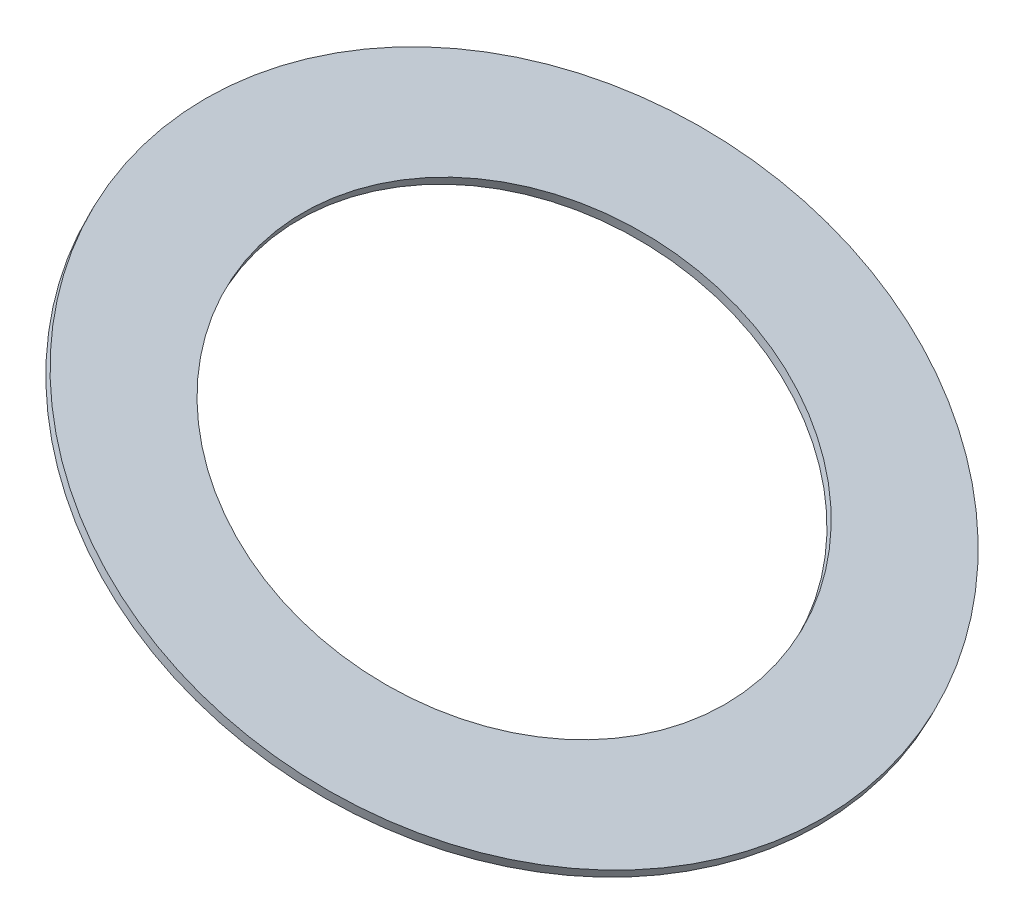
ISO-10303-21;
HEADER;
FILE_DESCRIPTION(('STEP AP214'),'2;1');
FILE_NAME('part.step','',(''),(''),'','','');
FILE_SCHEMA(('AUTOMOTIVE_DESIGN { 1 0 10303 214 1 1 1 1 }'));
ENDSEC;
DATA;
#1=APPLICATION_CONTEXT('core data for automotive mechanical design processes');
#2=APPLICATION_PROTOCOL_DEFINITION('international standard','automotive_design',2000,#1);
#3=PRODUCT_CONTEXT('',#1,'mechanical');
#4=PRODUCT('Part','Part','',(#3));
#5=PRODUCT_RELATED_PRODUCT_CATEGORY('part','',(#4));
#6=PRODUCT_DEFINITION_FORMATION('','',#4);
#7=PRODUCT_DEFINITION_CONTEXT('part definition',#1,'design');
#8=PRODUCT_DEFINITION('design','',#6,#7);
#9=PRODUCT_DEFINITION_SHAPE('','',#8);
#10=(LENGTH_UNIT() NAMED_UNIT(*) SI_UNIT(.MILLI.,.METRE.));
#11=(NAMED_UNIT(*) PLANE_ANGLE_UNIT() SI_UNIT($,.RADIAN.));
#12=(NAMED_UNIT(*) SI_UNIT($,.STERADIAN.) SOLID_ANGLE_UNIT());
#13=UNCERTAINTY_MEASURE_WITH_UNIT(LENGTH_MEASURE(1.E-05),#10,'distance_accuracy_value','');
#14=(GEOMETRIC_REPRESENTATION_CONTEXT(3) GLOBAL_UNCERTAINTY_ASSIGNED_CONTEXT((#13)) GLOBAL_UNIT_ASSIGNED_CONTEXT((#10,
#11,#12)) REPRESENTATION_CONTEXT('',''));
#15=CARTESIAN_POINT('',(0.,0.,0.));
#16=DIRECTION('',(0.,0.,1.));
#17=DIRECTION('',(1.,0.,0.));
#18=AXIS2_PLACEMENT_3D('',#15,#16,#17);
#19=CARTESIAN_POINT('',(361.37643779268,709.241193253941,0.));
#20=DIRECTION('',(-0.453990499739548,-0.891006524188368,0.));
#21=DIRECTION('',(0.891006524188367,-0.453990499739548,0.));
#22=AXIS2_PLACEMENT_3D('',#19,#20,#21);
#23=CYLINDRICAL_SURFACE('',#22,102.5);
#24=CARTESIAN_POINT('',(361.37643779268,709.241193253941,0.));
#25=DIRECTION('',(-0.453990499739548,-0.891006524188368,0.));
#26=DIRECTION('',(0.891006524188367,-0.453990499739548,0.));
#27=AXIS2_PLACEMENT_3D('',#24,#25,#26);
#28=CIRCLE('',#27,102.5);
#29=CARTESIAN_POINT('',(452.704606521988,662.707167030637,0.));
#30=VERTEX_POINT('',#29);
#31=EDGE_CURVE('E44',#30,#30,#28,.T.);
#32=ORIENTED_EDGE('',*,*,#31,.T.);
#33=EDGE_LOOP('',(#32));
#34=FACE_BOUND('',#33,.T.);
#35=CARTESIAN_POINT('',(363.192399791638,712.805219350694,0.));
#36=DIRECTION('',(-0.453990499739548,-0.891006524188368,0.));
#37=DIRECTION('',(0.891006524188367,-0.453990499739548,0.));
#38=AXIS2_PLACEMENT_3D('',#35,#36,#37);
#39=CIRCLE('',#38,102.5);
#40=CARTESIAN_POINT('',(454.520568520946,666.271193127391,0.));
#41=VERTEX_POINT('',#40);
#42=EDGE_CURVE('E50',#41,#41,#39,.T.);
#43=ORIENTED_EDGE('',*,*,#42,.F.);
#44=EDGE_LOOP('',(#43));
#45=FACE_BOUND('',#44,.T.);
#46=ADVANCED_FACE('F36',(#34,#45),#23,.F.);
#47=CARTESIAN_POINT('',(361.37643779268,709.241193253941,0.));
#48=DIRECTION('',(-0.453990499739548,-0.891006524188368,0.));
#49=DIRECTION('',(0.891006524188367,-0.453990499739548,0.));
#50=AXIS2_PLACEMENT_3D('',#47,#48,#49);
#51=CYLINDRICAL_SURFACE('',#50,150.);
#52=CARTESIAN_POINT('',(361.37643779268,709.241193253941,0.));
#53=DIRECTION('',(-0.453990499739548,-0.891006524188368,0.));
#54=DIRECTION('',(0.891006524188367,-0.453990499739548,0.));
#55=AXIS2_PLACEMENT_3D('',#52,#53,#54);
#56=CIRCLE('',#55,150.);
#57=CARTESIAN_POINT('',(495.027416420935,641.142618293009,0.));
#58=VERTEX_POINT('',#57);
#59=EDGE_CURVE('E10',#58,#58,#56,.T.);
#60=ORIENTED_EDGE('',*,*,#59,.F.);
#61=EDGE_LOOP('',(#60));
#62=FACE_BOUND('',#61,.T.);
#63=CARTESIAN_POINT('',(363.192399791638,712.805219350694,0.));
#64=DIRECTION('',(-0.453990499739548,-0.891006524188368,0.));
#65=DIRECTION('',(0.891006524188367,-0.453990499739548,0.));
#66=AXIS2_PLACEMENT_3D('',#63,#64,#65);
#67=CIRCLE('',#66,150.);
#68=CARTESIAN_POINT('',(496.843378419893,644.706644389762,0.));
#69=VERTEX_POINT('',#68);
#70=EDGE_CURVE('E40',#69,#69,#67,.T.);
#71=ORIENTED_EDGE('',*,*,#70,.T.);
#72=EDGE_LOOP('',(#71));
#73=FACE_BOUND('',#72,.T.);
#74=ADVANCED_FACE('F57',(#62,#73),#51,.T.);
#75=CARTESIAN_POINT('',(361.37643779268,709.241193253941,0.));
#76=DIRECTION('',(-0.453990499739548,-0.891006524188368,0.));
#77=DIRECTION('',(0.891006524188367,-0.453990499739548,0.));
#78=AXIS2_PLACEMENT_3D('',#75,#76,#77);
#79=PLANE('',#78);
#80=ORIENTED_EDGE('',*,*,#31,.F.);
#81=EDGE_LOOP('',(#80));
#82=FACE_BOUND('',#81,.T.);
#83=ORIENTED_EDGE('',*,*,#59,.T.);
#84=EDGE_LOOP('',(#83));
#85=FACE_BOUND('',#84,.T.);
#86=ADVANCED_FACE('F38',(#82,#85),#79,.T.);
#87=CARTESIAN_POINT('',(363.192399791638,712.805219350694,0.));
#88=DIRECTION('',(-0.453990499739548,-0.891006524188368,0.));
#89=DIRECTION('',(0.891006524188367,-0.453990499739548,0.));
#90=AXIS2_PLACEMENT_3D('',#87,#88,#89);
#91=PLANE('',#90);
#92=ORIENTED_EDGE('',*,*,#42,.T.);
#93=EDGE_LOOP('',(#92));
#94=FACE_BOUND('',#93,.T.);
#95=ORIENTED_EDGE('',*,*,#70,.F.);
#96=EDGE_LOOP('',(#95));
#97=FACE_BOUND('',#96,.T.);
#98=ADVANCED_FACE('F59',(#94,#97),#91,.F.);
#99=CLOSED_SHELL('',(#46,#74,#86,#98));
#100=MANIFOLD_SOLID_BREP('B2',#99);
#101=ADVANCED_BREP_SHAPE_REPRESENTATION('',(#18,#100),#14);
#102=SHAPE_DEFINITION_REPRESENTATION(#9,#101);
ENDSEC;
END-ISO-10303-21;
